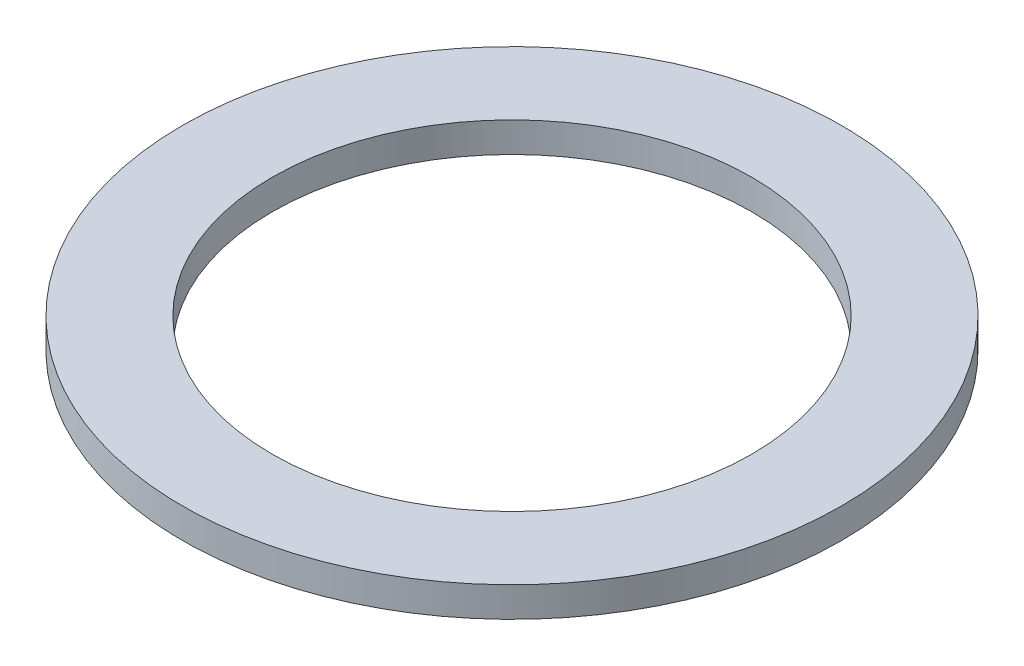
ISO-10303-21;
HEADER;
FILE_DESCRIPTION(('STEP AP214'),'2;1');
FILE_NAME('part.step','',(''),(''),'','','');
FILE_SCHEMA(('AUTOMOTIVE_DESIGN { 1 0 10303 214 1 1 1 1 }'));
ENDSEC;
DATA;
#1=APPLICATION_CONTEXT('core data for automotive mechanical design processes');
#2=APPLICATION_PROTOCOL_DEFINITION('international standard','automotive_design',2000,#1);
#3=PRODUCT_CONTEXT('',#1,'mechanical');
#4=PRODUCT('Part','Part','',(#3));
#5=PRODUCT_RELATED_PRODUCT_CATEGORY('part','',(#4));
#6=PRODUCT_DEFINITION_FORMATION('','',#4);
#7=PRODUCT_DEFINITION_CONTEXT('part definition',#1,'design');
#8=PRODUCT_DEFINITION('design','',#6,#7);
#9=PRODUCT_DEFINITION_SHAPE('','',#8);
#10=(LENGTH_UNIT() NAMED_UNIT(*) SI_UNIT(.MILLI.,.METRE.));
#11=(NAMED_UNIT(*) PLANE_ANGLE_UNIT() SI_UNIT($,.RADIAN.));
#12=(NAMED_UNIT(*) SI_UNIT($,.STERADIAN.) SOLID_ANGLE_UNIT());
#13=UNCERTAINTY_MEASURE_WITH_UNIT(LENGTH_MEASURE(1.E-05),#10,'distance_accuracy_value','');
#14=(GEOMETRIC_REPRESENTATION_CONTEXT(3) GLOBAL_UNCERTAINTY_ASSIGNED_CONTEXT((#13)) GLOBAL_UNIT_ASSIGNED_CONTEXT((#10,
#11,#12)) REPRESENTATION_CONTEXT('',''));
#15=CARTESIAN_POINT('',(0.,0.,0.));
#16=DIRECTION('',(0.,0.,1.));
#17=DIRECTION('',(1.,0.,0.));
#18=AXIS2_PLACEMENT_3D('',#15,#16,#17);
#19=CARTESIAN_POINT('',(0.,0.,0.));
#20=DIRECTION('',(0.,-1.,0.));
#21=DIRECTION('',(1.,0.,0.));
#22=AXIS2_PLACEMENT_3D('',#19,#20,#21);
#23=CYLINDRICAL_SURFACE('',#22,25.4);
#24=CARTESIAN_POINT('',(0.,3.175,0.));
#25=DIRECTION('',(0.,-1.,0.));
#26=DIRECTION('',(1.,0.,0.));
#27=AXIS2_PLACEMENT_3D('',#24,#25,#26);
#28=CIRCLE('',#27,25.4);
#29=CARTESIAN_POINT('',(25.4,3.175,0.));
#30=VERTEX_POINT('',#29);
#31=EDGE_CURVE('E48',#30,#30,#28,.T.);
#32=ORIENTED_EDGE('',*,*,#31,.F.);
#33=EDGE_LOOP('',(#32));
#34=FACE_BOUND('',#33,.T.);
#35=CARTESIAN_POINT('',(0.,0.,0.));
#36=DIRECTION('',(0.,-1.,0.));
#37=DIRECTION('',(1.,0.,0.));
#38=AXIS2_PLACEMENT_3D('',#35,#36,#37);
#39=CIRCLE('',#38,25.4);
#40=CARTESIAN_POINT('',(25.4,0.,0.));
#41=VERTEX_POINT('',#40);
#42=EDGE_CURVE('E10',#41,#41,#39,.T.);
#43=ORIENTED_EDGE('',*,*,#42,.T.);
#44=EDGE_LOOP('',(#43));
#45=FACE_BOUND('',#44,.T.);
#46=ADVANCED_FACE('F34',(#34,#45),#23,.F.);
#47=CARTESIAN_POINT('',(-34.8996,0.,0.));
#48=DIRECTION('',(0.,1.,0.));
#49=DIRECTION('',(-1.,0.,0.));
#50=AXIS2_PLACEMENT_3D('',#47,#48,#49);
#51=PLANE('',#50);
#52=ORIENTED_EDGE('',*,*,#42,.F.);
#53=EDGE_LOOP('',(#52));
#54=FACE_BOUND('',#53,.T.);
#55=CARTESIAN_POINT('',(0.,0.,0.));
#56=DIRECTION('',(0.,-1.,0.));
#57=DIRECTION('',(1.,0.,0.));
#58=AXIS2_PLACEMENT_3D('',#55,#56,#57);
#59=CIRCLE('',#58,34.8996);
#60=CARTESIAN_POINT('',(34.8996,0.,0.));
#61=VERTEX_POINT('',#60);
#62=EDGE_CURVE('E40',#61,#61,#59,.T.);
#63=ORIENTED_EDGE('',*,*,#62,.T.);
#64=EDGE_LOOP('',(#63));
#65=FACE_BOUND('',#64,.T.);
#66=ADVANCED_FACE('F57',(#54,#65),#51,.F.);
#67=CARTESIAN_POINT('',(0.,0.,0.));
#68=DIRECTION('',(0.,-1.,0.));
#69=DIRECTION('',(1.,0.,0.));
#70=AXIS2_PLACEMENT_3D('',#67,#68,#69);
#71=CYLINDRICAL_SURFACE('',#70,34.8996);
#72=ORIENTED_EDGE('',*,*,#62,.F.);
#73=EDGE_LOOP('',(#72));
#74=FACE_BOUND('',#73,.T.);
#75=CARTESIAN_POINT('',(0.,3.175,0.));
#76=DIRECTION('',(0.,-1.,0.));
#77=DIRECTION('',(1.,0.,0.));
#78=AXIS2_PLACEMENT_3D('',#75,#76,#77);
#79=CIRCLE('',#78,34.8996);
#80=CARTESIAN_POINT('',(34.8996,3.175,0.));
#81=VERTEX_POINT('',#80);
#82=EDGE_CURVE('E44',#81,#81,#79,.T.);
#83=ORIENTED_EDGE('',*,*,#82,.T.);
#84=EDGE_LOOP('',(#83));
#85=FACE_BOUND('',#84,.T.);
#86=ADVANCED_FACE('F61',(#74,#85),#71,.T.);
#87=CARTESIAN_POINT('',(-34.8996,3.175,0.));
#88=DIRECTION('',(0.,-1.,0.));
#89=DIRECTION('',(1.,0.,0.));
#90=AXIS2_PLACEMENT_3D('',#87,#88,#89);
#91=PLANE('',#90);
#92=ORIENTED_EDGE('',*,*,#82,.F.);
#93=EDGE_LOOP('',(#92));
#94=FACE_BOUND('',#93,.T.);
#95=ORIENTED_EDGE('',*,*,#31,.T.);
#96=EDGE_LOOP('',(#95));
#97=FACE_BOUND('',#96,.T.);
#98=ADVANCED_FACE('F54',(#94,#97),#91,.F.);
#99=CLOSED_SHELL('',(#46,#66,#86,#98));
#100=MANIFOLD_SOLID_BREP('B2',#99);
#101=ADVANCED_BREP_SHAPE_REPRESENTATION('',(#18,#100),#14);
#102=SHAPE_DEFINITION_REPRESENTATION(#9,#101);
ENDSEC;
END-ISO-10303-21;
